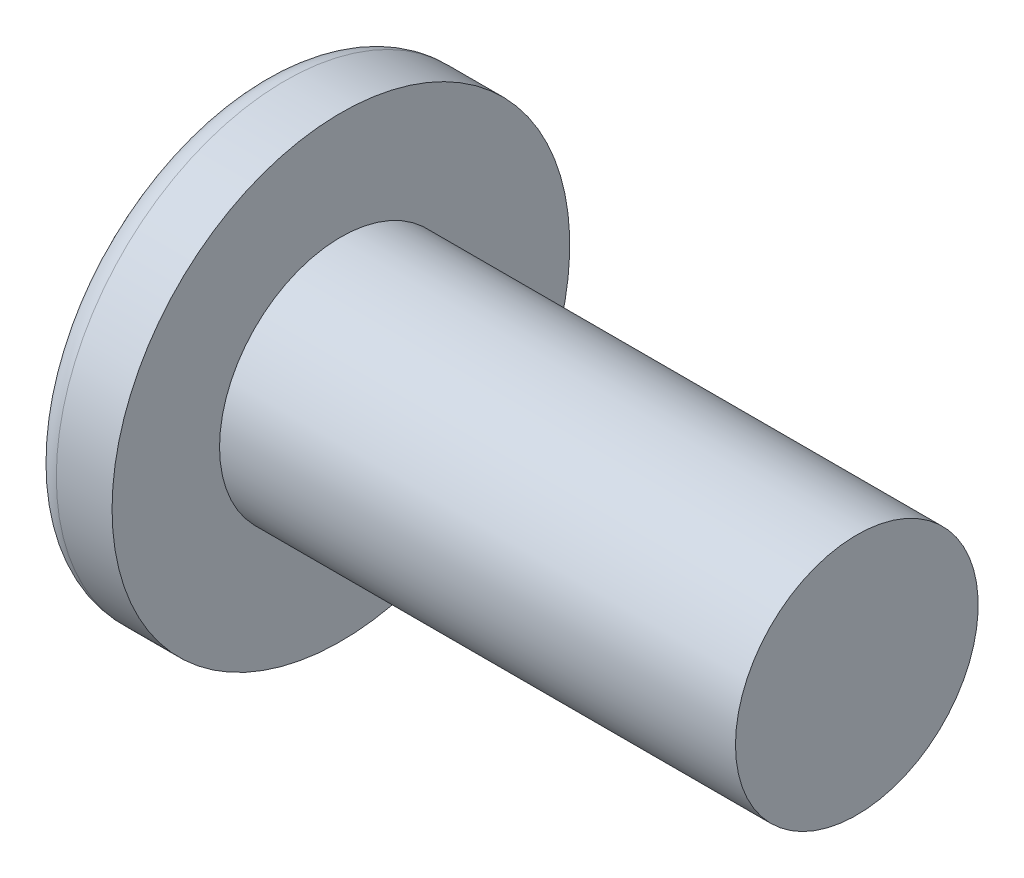
ISO-10303-21;
HEADER;
FILE_DESCRIPTION(('STEP AP214'),'2;1');
FILE_NAME('part.step','',(''),(''),'','','');
FILE_SCHEMA(('AUTOMOTIVE_DESIGN { 1 0 10303 214 1 1 1 1 }'));
ENDSEC;
DATA;
#1=APPLICATION_CONTEXT('core data for automotive mechanical design processes');
#2=APPLICATION_PROTOCOL_DEFINITION('international standard','automotive_design',2000,#1);
#3=PRODUCT_CONTEXT('',#1,'mechanical');
#4=PRODUCT('Part','Part','',(#3));
#5=PRODUCT_RELATED_PRODUCT_CATEGORY('part','',(#4));
#6=PRODUCT_DEFINITION_FORMATION('','',#4);
#7=PRODUCT_DEFINITION_CONTEXT('part definition',#1,'design');
#8=PRODUCT_DEFINITION('design','',#6,#7);
#9=PRODUCT_DEFINITION_SHAPE('','',#8);
#10=(LENGTH_UNIT() NAMED_UNIT(*) SI_UNIT(.MILLI.,.METRE.));
#11=(NAMED_UNIT(*) PLANE_ANGLE_UNIT() SI_UNIT($,.RADIAN.));
#12=(NAMED_UNIT(*) SI_UNIT($,.STERADIAN.) SOLID_ANGLE_UNIT());
#13=UNCERTAINTY_MEASURE_WITH_UNIT(LENGTH_MEASURE(1.E-05),#10,'distance_accuracy_value','');
#14=(GEOMETRIC_REPRESENTATION_CONTEXT(3) GLOBAL_UNCERTAINTY_ASSIGNED_CONTEXT((#13)) GLOBAL_UNIT_ASSIGNED_CONTEXT((#10,
#11,#12)) REPRESENTATION_CONTEXT('',''));
#15=CARTESIAN_POINT('',(0.,0.,0.));
#16=DIRECTION('',(0.,0.,1.));
#17=DIRECTION('',(1.,0.,0.));
#18=AXIS2_PLACEMENT_3D('',#15,#16,#17);
#19=CARTESIAN_POINT('',(6.6,0.,0.));
#20=DIRECTION('',(-1.,0.,0.));
#21=DIRECTION('',(0.,1.,0.));
#22=AXIS2_PLACEMENT_3D('',#19,#20,#21);
#23=SPHERICAL_SURFACE('',#22,6.6);
#24=CARTESIAN_POINT('',(0.778463075805213,0.,0.));
#25=DIRECTION('',(-1.,0.,0.));
#26=DIRECTION('',(0.,0.,1.));
#27=AXIS2_PLACEMENT_3D('',#24,#25,#26);
#28=CIRCLE('',#27,3.10961538461538);
#29=CARTESIAN_POINT('',(0.778463075805213,0.,3.10961538461538));
#30=VERTEX_POINT('',#29);
#31=EDGE_CURVE('E152',#30,#30,#28,.T.);
#32=ORIENTED_EDGE('',*,*,#31,.T.);
#33=EDGE_LOOP('',(#32));
#34=FACE_BOUND('',#33,.T.);
#35=CARTESIAN_POINT('',(6.56634135049053,-0.32021201695497,0.));
#36=DIRECTION('',(-0.104537710696287,-0.994520923380891,0.));
#37=DIRECTION('',(0.994520923380891,-0.104537710696287,0.));
#38=AXIS2_PLACEMENT_3D('',#35,#36,#37);
#39=CIRCLE('',#38,6.59214163679079);
#40=CARTESIAN_POINT('',(0.147950510546276,0.35444838383462,1.34366057054486));
#41=VERTEX_POINT('',#40);
#42=CARTESIAN_POINT('',(0.0205330780491553,0.367841693500514,0.367841693500515));
#43=VERTEX_POINT('',#42);
#44=EDGE_CURVE('E183',#41,#43,#39,.T.);
#45=ORIENTED_EDGE('',*,*,#44,.F.);
#46=CARTESIAN_POINT('',(5.03902124919511,0.,-2.17179652285898));
#47=DIRECTION('',(0.583636048152575,0.,0.812015371342713));
#48=DIRECTION('',(0.812015371342714,0.,-0.583636048152575));
#49=AXIS2_PLACEMENT_3D('',#46,#47,#48);
#50=CIRCLE('',#49,6.03379194228913);
#51=CARTESIAN_POINT('',(0.147950510546276,-0.354448383834629,1.34366057054486));
#52=VERTEX_POINT('',#51);
#53=EDGE_CURVE('E148',#41,#52,#50,.T.);
#54=ORIENTED_EDGE('',*,*,#53,.T.);
#55=CARTESIAN_POINT('',(6.56634135049053,0.320212016954969,0.));
#56=DIRECTION('',(-0.104537710696287,0.994520923380891,0.));
#57=DIRECTION('',(-0.994520923380891,-0.104537710696287,0.));
#58=AXIS2_PLACEMENT_3D('',#55,#56,#57);
#59=CIRCLE('',#58,6.59214163679079);
#60=CARTESIAN_POINT('',(0.0205330780491545,-0.367841693500516,0.367841693500515));
#61=VERTEX_POINT('',#60);
#62=EDGE_CURVE('E104',#61,#52,#59,.T.);
#63=ORIENTED_EDGE('',*,*,#62,.F.);
#64=CARTESIAN_POINT('',(6.56634135049053,0.,-0.320212016954969));
#65=DIRECTION('',(-0.104537710696287,0.,-0.994520923380891));
#66=DIRECTION('',(-0.994520923380891,0.,0.104537710696287));
#67=AXIS2_PLACEMENT_3D('',#64,#65,#66);
#68=CIRCLE('',#67,6.59214163679079);
#69=CARTESIAN_POINT('',(0.147950510546277,-1.34366057054486,0.354448383834624));
#70=VERTEX_POINT('',#69);
#71=EDGE_CURVE('E129',#70,#61,#68,.T.);
#72=ORIENTED_EDGE('',*,*,#71,.F.);
#73=CARTESIAN_POINT('',(5.03902124919511,2.17179652285898,0.));
#74=DIRECTION('',(0.583636048152575,-0.812015371342713,0.));
#75=DIRECTION('',(0.812015371342714,0.583636048152575,0.));
#76=AXIS2_PLACEMENT_3D('',#73,#74,#75);
#77=CIRCLE('',#76,6.03379194228913);
#78=CARTESIAN_POINT('',(0.147950510546277,-1.34366057054486,-0.354448383834624));
#79=VERTEX_POINT('',#78);
#80=EDGE_CURVE('E137',#70,#79,#77,.T.);
#81=ORIENTED_EDGE('',*,*,#80,.T.);
#82=CARTESIAN_POINT('',(6.56634135049053,0.,0.32021201695497));
#83=DIRECTION('',(-0.104537710696287,0.,0.994520923380891));
#84=DIRECTION('',(0.994520923380891,0.,0.104537710696287));
#85=AXIS2_PLACEMENT_3D('',#82,#83,#84);
#86=CIRCLE('',#85,6.59214163679079);
#87=CARTESIAN_POINT('',(0.0205330780491553,-0.367841693500513,-0.367841693500515));
#88=VERTEX_POINT('',#87);
#89=EDGE_CURVE('E47',#88,#79,#86,.T.);
#90=ORIENTED_EDGE('',*,*,#89,.F.);
#91=CARTESIAN_POINT('',(0.147950510546278,-0.354448383834619,-1.34366057054487));
#92=VERTEX_POINT('',#91);
#93=EDGE_CURVE('E190',#92,#88,#59,.T.);
#94=ORIENTED_EDGE('',*,*,#93,.F.);
#95=CARTESIAN_POINT('',(5.03902124919511,0.,2.17179652285898));
#96=DIRECTION('',(0.583636048152575,0.,-0.812015371342713));
#97=DIRECTION('',(-0.812015371342714,0.,-0.583636048152575));
#98=AXIS2_PLACEMENT_3D('',#95,#96,#97);
#99=CIRCLE('',#98,6.03379194228913);
#100=CARTESIAN_POINT('',(0.147950510546278,0.354448383834629,-1.34366057054486));
#101=VERTEX_POINT('',#100);
#102=EDGE_CURVE('E130',#92,#101,#99,.T.);
#103=ORIENTED_EDGE('',*,*,#102,.T.);
#104=CARTESIAN_POINT('',(0.0205330780491545,0.367841693500516,-0.367841693500515));
#105=VERTEX_POINT('',#104);
#106=EDGE_CURVE('E178',#105,#101,#39,.T.);
#107=ORIENTED_EDGE('',*,*,#106,.F.);
#108=CARTESIAN_POINT('',(0.147950510546276,1.34366057054486,-0.354448383834624));
#109=VERTEX_POINT('',#108);
#110=EDGE_CURVE('E40',#109,#105,#86,.T.);
#111=ORIENTED_EDGE('',*,*,#110,.F.);
#112=CARTESIAN_POINT('',(5.03902124919511,-2.17179652285898,0.));
#113=DIRECTION('',(0.583636048152575,0.812015371342713,0.));
#114=DIRECTION('',(-0.812015371342714,0.583636048152575,0.));
#115=AXIS2_PLACEMENT_3D('',#112,#113,#114);
#116=CIRCLE('',#115,6.03379194228913);
#117=CARTESIAN_POINT('',(0.147950510546277,1.34366057054486,0.354448383834624));
#118=VERTEX_POINT('',#117);
#119=EDGE_CURVE('E11',#109,#118,#116,.T.);
#120=ORIENTED_EDGE('',*,*,#119,.T.);
#121=EDGE_CURVE('E166',#43,#118,#68,.T.);
#122=ORIENTED_EDGE('',*,*,#121,.F.);
#123=EDGE_LOOP('',(#45,#54,#63,#72,#81,#90,#94,#103,#107,#111,#120,#122));
#124=FACE_BOUND('',#123,.T.);
#125=ADVANCED_FACE('F32',(#34,#124),#23,.T.);
#126=CARTESIAN_POINT('',(2.01739130434783,0.,-0.15794466403162));
#127=DIRECTION('',(-0.104537710696287,0.,0.994520923380891));
#128=DIRECTION('',(0.994520923380891,0.,0.104537710696287));
#129=AXIS2_PLACEMENT_3D('',#126,#127,#128);
#130=PLANE('',#129);
#131=ORIENTED_EDGE('',*,*,#110,.T.);
#132=DIRECTION('',(0.989130931836555,-0.103971149085093,0.103971149085092));
#133=VECTOR('',#132,1.);
#134=CARTESIAN_POINT('',(2.03363450411053,0.156237282238383,-0.156237282238382));
#135=LINE('',#134,#133);
#136=CARTESIAN_POINT('',(1.76,0.185000000000001,-0.184999999999999));
#137=VERTEX_POINT('',#136);
#138=EDGE_CURVE('E172',#105,#137,#135,.T.);
#139=ORIENTED_EDGE('',*,*,#138,.T.);
#140=DIRECTION('',(0.80907355338853,-0.581521616498006,0.0850446632823171));
#141=VECTOR('',#140,1.);
#142=CARTESIAN_POINT('',(0.,1.45,-0.37));
#143=LINE('',#142,#141);
#144=EDGE_CURVE('E153',#109,#137,#143,.T.);
#145=ORIENTED_EDGE('',*,*,#144,.F.);
#146=EDGE_LOOP('',(#131,#139,#145));
#147=FACE_BOUND('',#146,.T.);
#148=ADVANCED_FACE('F171',(#147),#130,.T.);
#149=DIRECTION('',(0.80907355338853,0.581521616498006,0.0850446632823171));
#150=VECTOR('',#149,1.);
#151=CARTESIAN_POINT('',(0.,-1.45,-0.37));
#152=LINE('',#151,#150);
#153=CARTESIAN_POINT('',(1.76,-0.185,-0.185));
#154=VERTEX_POINT('',#153);
#155=EDGE_CURVE('E138',#79,#154,#152,.T.);
#156=ORIENTED_EDGE('',*,*,#155,.T.);
#157=DIRECTION('',(-0.989130931836555,-0.103971149085092,-0.103971149085092));
#158=VECTOR('',#157,1.);
#159=CARTESIAN_POINT('',(2.03363450411053,-0.156237282238382,-0.156237282238382));
#160=LINE('',#159,#158);
#161=EDGE_CURVE('E193',#154,#88,#160,.T.);
#162=ORIENTED_EDGE('',*,*,#161,.T.);
#163=ORIENTED_EDGE('',*,*,#89,.T.);
#164=EDGE_LOOP('',(#156,#162,#163));
#165=FACE_BOUND('',#164,.T.);
#166=ADVANCED_FACE('F208',(#165),#130,.T.);
#167=CARTESIAN_POINT('',(2.01739130434783,0.,0.157944664031621));
#168=DIRECTION('',(-0.104537710696287,0.,-0.994520923380891));
#169=DIRECTION('',(-0.994520923380891,0.,0.104537710696287));
#170=AXIS2_PLACEMENT_3D('',#167,#168,#169);
#171=PLANE('',#170);
#172=DIRECTION('',(0.80907355338853,-0.581521616498006,-0.085044663282317));
#173=VECTOR('',#172,1.);
#174=CARTESIAN_POINT('',(0.,1.45,0.37));
#175=LINE('',#174,#173);
#176=CARTESIAN_POINT('',(1.76,0.185,0.185));
#177=VERTEX_POINT('',#176);
#178=EDGE_CURVE('E209',#118,#177,#175,.T.);
#179=ORIENTED_EDGE('',*,*,#178,.T.);
#180=DIRECTION('',(-0.989130931836555,0.103971149085092,0.103971149085092));
#181=VECTOR('',#180,1.);
#182=CARTESIAN_POINT('',(2.03363450411053,0.156237282238382,0.156237282238382));
#183=LINE('',#182,#181);
#184=EDGE_CURVE('E187',#177,#43,#183,.T.);
#185=ORIENTED_EDGE('',*,*,#184,.T.);
#186=ORIENTED_EDGE('',*,*,#121,.T.);
#187=EDGE_LOOP('',(#179,#185,#186));
#188=FACE_BOUND('',#187,.T.);
#189=ADVANCED_FACE('F213',(#188),#171,.T.);
#190=ORIENTED_EDGE('',*,*,#71,.T.);
#191=DIRECTION('',(0.989130931836555,0.103971149085093,-0.103971149085092));
#192=VECTOR('',#191,1.);
#193=CARTESIAN_POINT('',(2.03363450411053,-0.156237282238383,0.156237282238382));
#194=LINE('',#193,#192);
#195=CARTESIAN_POINT('',(1.76,-0.185000000000001,0.184999999999999));
#196=VERTEX_POINT('',#195);
#197=EDGE_CURVE('E102',#61,#196,#194,.T.);
#198=ORIENTED_EDGE('',*,*,#197,.T.);
#199=DIRECTION('',(0.80907355338853,0.581521616498006,-0.0850446632823168));
#200=VECTOR('',#199,1.);
#201=CARTESIAN_POINT('',(0.,-1.45,0.369999999999999));
#202=LINE('',#201,#200);
#203=EDGE_CURVE('E127',#70,#196,#202,.T.);
#204=ORIENTED_EDGE('',*,*,#203,.F.);
#205=EDGE_LOOP('',(#190,#198,#204));
#206=FACE_BOUND('',#205,.T.);
#207=ADVANCED_FACE('F126',(#206),#171,.T.);
#208=CARTESIAN_POINT('',(-25.4,0.,0.));
#209=DIRECTION('',(-1.,0.,0.));
#210=DIRECTION('',(0.,0.,1.));
#211=AXIS2_PLACEMENT_3D('',#208,#209,#210);
#212=CYLINDRICAL_SURFACE('',#211,1.75);
#213=CARTESIAN_POINT('',(9.34,0.,0.));
#214=DIRECTION('',(-1.,0.,0.));
#215=DIRECTION('',(0.,0.,1.));
#216=AXIS2_PLACEMENT_3D('',#213,#214,#215);
#217=CIRCLE('',#216,1.75);
#218=CARTESIAN_POINT('',(9.34,0.,1.75));
#219=VERTEX_POINT('',#218);
#220=EDGE_CURVE('E149',#219,#219,#217,.T.);
#221=ORIENTED_EDGE('',*,*,#220,.T.);
#222=EDGE_LOOP('',(#221));
#223=FACE_BOUND('',#222,.T.);
#224=CARTESIAN_POINT('',(1.9,0.,0.));
#225=DIRECTION('',(-1.,0.,0.));
#226=DIRECTION('',(0.,0.,1.));
#227=AXIS2_PLACEMENT_3D('',#224,#225,#226);
#228=CIRCLE('',#227,1.75);
#229=CARTESIAN_POINT('',(1.9,0.,1.75));
#230=VERTEX_POINT('',#229);
#231=EDGE_CURVE('E162',#230,#230,#228,.T.);
#232=ORIENTED_EDGE('',*,*,#231,.F.);
#233=EDGE_LOOP('',(#232));
#234=FACE_BOUND('',#233,.T.);
#235=ADVANCED_FACE('F34',(#223,#234),#212,.T.);
#236=CARTESIAN_POINT('',(1.9,1.75,0.));
#237=DIRECTION('',(-1.,0.,0.));
#238=DIRECTION('',(0.,0.,1.));
#239=AXIS2_PLACEMENT_3D('',#236,#237,#238);
#240=PLANE('',#239);
#241=CARTESIAN_POINT('',(1.9,0.,0.));
#242=DIRECTION('',(-1.,0.,0.));
#243=DIRECTION('',(0.,0.,1.));
#244=AXIS2_PLACEMENT_3D('',#241,#242,#243);
#245=CIRCLE('',#244,3.3);
#246=CARTESIAN_POINT('',(1.9,0.,3.3));
#247=VERTEX_POINT('',#246);
#248=EDGE_CURVE('E159',#247,#247,#245,.T.);
#249=ORIENTED_EDGE('',*,*,#248,.F.);
#250=EDGE_LOOP('',(#249));
#251=FACE_BOUND('',#250,.T.);
#252=ORIENTED_EDGE('',*,*,#231,.T.);
#253=EDGE_LOOP('',(#252));
#254=FACE_BOUND('',#253,.T.);
#255=ADVANCED_FACE('F241',(#251,#254),#240,.F.);
#256=CARTESIAN_POINT('',(-25.4,0.,0.));
#257=DIRECTION('',(-1.,0.,0.));
#258=DIRECTION('',(0.,0.,1.));
#259=AXIS2_PLACEMENT_3D('',#256,#257,#258);
#260=CYLINDRICAL_SURFACE('',#259,3.3);
#261=ORIENTED_EDGE('',*,*,#248,.T.);
#262=EDGE_LOOP('',(#261));
#263=FACE_BOUND('',#262,.T.);
#264=CARTESIAN_POINT('',(1.09600145348857,0.,0.));
#265=DIRECTION('',(-1.,0.,0.));
#266=DIRECTION('',(0.,0.,1.));
#267=AXIS2_PLACEMENT_3D('',#264,#265,#266);
#268=CIRCLE('',#267,3.3);
#269=CARTESIAN_POINT('',(1.09600145348857,0.,3.3));
#270=VERTEX_POINT('',#269);
#271=EDGE_CURVE('E156',#270,#270,#268,.T.);
#272=ORIENTED_EDGE('',*,*,#271,.F.);
#273=EDGE_LOOP('',(#272));
#274=FACE_BOUND('',#273,.T.);
#275=ADVANCED_FACE('F238',(#263,#274),#260,.T.);
#276=CARTESIAN_POINT('',(1.09600145348856,0.,0.));
#277=DIRECTION('',(-1.,0.,0.));
#278=DIRECTION('',(0.,0.,1.));
#279=AXIS2_PLACEMENT_3D('',#276,#277,#278);
#280=TOROIDAL_SURFACE('',#279,2.94,0.359999999999999);
#281=ORIENTED_EDGE('',*,*,#271,.T.);
#282=EDGE_LOOP('',(#281));
#283=FACE_BOUND('',#282,.T.);
#284=ORIENTED_EDGE('',*,*,#31,.F.);
#285=EDGE_LOOP('',(#284));
#286=FACE_BOUND('',#285,.T.);
#287=ADVANCED_FACE('F235',(#283,#286),#280,.T.);
#288=CARTESIAN_POINT('',(9.34,1.75,0.));
#289=DIRECTION('',(1.,0.,0.));
#290=DIRECTION('',(0.,0.,-1.));
#291=AXIS2_PLACEMENT_3D('',#288,#289,#290);
#292=PLANE('',#291);
#293=ORIENTED_EDGE('',*,*,#220,.F.);
#294=EDGE_LOOP('',(#293));
#295=FACE_BOUND('',#294,.T.);
#296=ADVANCED_FACE('F233',(#295),#292,.T.);
#297=CARTESIAN_POINT('',(1.76,0.185,0.185));
#298=DIRECTION('',(0.583636048152575,0.812015371342713,0.));
#299=DIRECTION('',(-0.812015371342714,0.583636048152575,0.));
#300=AXIS2_PLACEMENT_3D('',#297,#298,#299);
#301=PLANE('',#300);
#302=ORIENTED_EDGE('',*,*,#144,.T.);
#303=DIRECTION('',(0.,0.,-1.));
#304=VECTOR('',#303,1.);
#305=CARTESIAN_POINT('',(1.76,0.185,0.185));
#306=LINE('',#305,#304);
#307=EDGE_CURVE('E120',#177,#137,#306,.T.);
#308=ORIENTED_EDGE('',*,*,#307,.F.);
#309=ORIENTED_EDGE('',*,*,#178,.F.);
#310=ORIENTED_EDGE('',*,*,#119,.F.);
#311=EDGE_LOOP('',(#302,#308,#309,#310));
#312=FACE_BOUND('',#311,.T.);
#313=ADVANCED_FACE('F212',(#312),#301,.F.);
#314=CARTESIAN_POINT('',(1.76,-0.185,-0.185));
#315=DIRECTION('',(0.583636048152575,-0.812015371342713,0.));
#316=DIRECTION('',(0.812015371342714,0.583636048152575,0.));
#317=AXIS2_PLACEMENT_3D('',#314,#315,#316);
#318=PLANE('',#317);
#319=ORIENTED_EDGE('',*,*,#203,.T.);
#320=DIRECTION('',(0.,0.,1.));
#321=VECTOR('',#320,1.);
#322=CARTESIAN_POINT('',(1.76,-0.185,-0.185));
#323=LINE('',#322,#321);
#324=EDGE_CURVE('E119',#154,#196,#323,.T.);
#325=ORIENTED_EDGE('',*,*,#324,.F.);
#326=ORIENTED_EDGE('',*,*,#155,.F.);
#327=ORIENTED_EDGE('',*,*,#80,.F.);
#328=EDGE_LOOP('',(#319,#325,#326,#327));
#329=FACE_BOUND('',#328,.T.);
#330=ADVANCED_FACE('F134',(#329),#318,.F.);
#331=CARTESIAN_POINT('',(1.76,0.185,-0.185));
#332=DIRECTION('',(-1.,0.,0.));
#333=DIRECTION('',(0.,0.,1.));
#334=AXIS2_PLACEMENT_3D('',#331,#332,#333);
#335=PLANE('',#334);
#336=DIRECTION('',(0.,1.,0.));
#337=VECTOR('',#336,1.);
#338=CARTESIAN_POINT('',(1.76,-0.185,-0.185));
#339=LINE('',#338,#337);
#340=EDGE_CURVE('E142',#154,#137,#339,.T.);
#341=ORIENTED_EDGE('',*,*,#340,.F.);
#342=ORIENTED_EDGE('',*,*,#324,.T.);
#343=DIRECTION('',(0.,-1.,0.));
#344=VECTOR('',#343,1.);
#345=CARTESIAN_POINT('',(1.76,0.185,0.185));
#346=LINE('',#345,#344);
#347=EDGE_CURVE('E111',#177,#196,#346,.T.);
#348=ORIENTED_EDGE('',*,*,#347,.F.);
#349=ORIENTED_EDGE('',*,*,#307,.T.);
#350=EDGE_LOOP('',(#341,#342,#348,#349));
#351=FACE_BOUND('',#350,.T.);
#352=ADVANCED_FACE('F140',(#351),#335,.T.);
#353=CARTESIAN_POINT('',(1.76,0.185000000000001,-0.184999999999999));
#354=DIRECTION('',(0.583636048152575,0.,-0.812015371342713));
#355=DIRECTION('',(0.812015371342714,0.,0.583636048152575));
#356=AXIS2_PLACEMENT_3D('',#353,#354,#355);
#357=PLANE('',#356);
#358=DIRECTION('',(0.80907355338853,0.0850446632823148,0.581521616498006));
#359=VECTOR('',#358,1.);
#360=CARTESIAN_POINT('',(0.,-0.369999999999994,-1.45));
#361=LINE('',#360,#359);
#362=EDGE_CURVE('E198',#92,#154,#361,.T.);
#363=ORIENTED_EDGE('',*,*,#362,.T.);
#364=ORIENTED_EDGE('',*,*,#340,.T.);
#365=DIRECTION('',(0.80907355338853,-0.0850446632823191,0.581521616498006));
#366=VECTOR('',#365,1.);
#367=CARTESIAN_POINT('',(0.,0.370000000000005,-1.45));
#368=LINE('',#367,#366);
#369=EDGE_CURVE('E108',#101,#137,#368,.T.);
#370=ORIENTED_EDGE('',*,*,#369,.F.);
#371=ORIENTED_EDGE('',*,*,#102,.F.);
#372=EDGE_LOOP('',(#363,#364,#370,#371));
#373=FACE_BOUND('',#372,.T.);
#374=ADVANCED_FACE('F203',(#373),#357,.F.);
#375=CARTESIAN_POINT('',(2.01739130434783,-0.157944664031621,0.));
#376=DIRECTION('',(-0.104537710696287,0.994520923380891,0.));
#377=DIRECTION('',(-0.994520923380891,-0.104537710696287,0.));
#378=AXIS2_PLACEMENT_3D('',#375,#376,#377);
#379=PLANE('',#378);
#380=ORIENTED_EDGE('',*,*,#93,.T.);
#381=ORIENTED_EDGE('',*,*,#161,.F.);
#382=ORIENTED_EDGE('',*,*,#362,.F.);
#383=EDGE_LOOP('',(#380,#381,#382));
#384=FACE_BOUND('',#383,.T.);
#385=ADVANCED_FACE('F207',(#384),#379,.T.);
#386=CARTESIAN_POINT('',(2.01739130434783,0.15794466403162,0.));
#387=DIRECTION('',(-0.104537710696287,-0.994520923380891,0.));
#388=DIRECTION('',(0.994520923380891,-0.104537710696287,0.));
#389=AXIS2_PLACEMENT_3D('',#386,#387,#388);
#390=PLANE('',#389);
#391=ORIENTED_EDGE('',*,*,#106,.T.);
#392=ORIENTED_EDGE('',*,*,#369,.T.);
#393=ORIENTED_EDGE('',*,*,#138,.F.);
#394=EDGE_LOOP('',(#391,#392,#393));
#395=FACE_BOUND('',#394,.T.);
#396=ADVANCED_FACE('F201',(#395),#390,.T.);
#397=CARTESIAN_POINT('',(1.76,-0.185000000000001,0.184999999999999));
#398=DIRECTION('',(0.583636048152575,0.,0.812015371342713));
#399=DIRECTION('',(-0.812015371342714,0.,0.583636048152575));
#400=AXIS2_PLACEMENT_3D('',#397,#398,#399);
#401=PLANE('',#400);
#402=DIRECTION('',(0.80907355338853,-0.0850446632823151,-0.581521616498006));
#403=VECTOR('',#402,1.);
#404=CARTESIAN_POINT('',(0.,0.369999999999995,1.45));
#405=LINE('',#404,#403);
#406=EDGE_CURVE('E107',#41,#177,#405,.T.);
#407=ORIENTED_EDGE('',*,*,#406,.T.);
#408=ORIENTED_EDGE('',*,*,#347,.T.);
#409=DIRECTION('',(0.80907355338853,0.085044663282319,-0.581521616498006));
#410=VECTOR('',#409,1.);
#411=CARTESIAN_POINT('',(0.,-0.370000000000005,1.45));
#412=LINE('',#411,#410);
#413=EDGE_CURVE('E98',#52,#196,#412,.T.);
#414=ORIENTED_EDGE('',*,*,#413,.F.);
#415=ORIENTED_EDGE('',*,*,#53,.F.);
#416=EDGE_LOOP('',(#407,#408,#414,#415));
#417=FACE_BOUND('',#416,.T.);
#418=ADVANCED_FACE('F112',(#417),#401,.F.);
#419=ORIENTED_EDGE('',*,*,#44,.T.);
#420=ORIENTED_EDGE('',*,*,#184,.F.);
#421=ORIENTED_EDGE('',*,*,#406,.F.);
#422=EDGE_LOOP('',(#419,#420,#421));
#423=FACE_BOUND('',#422,.T.);
#424=ADVANCED_FACE('F214',(#423),#390,.T.);
#425=ORIENTED_EDGE('',*,*,#62,.T.);
#426=ORIENTED_EDGE('',*,*,#413,.T.);
#427=ORIENTED_EDGE('',*,*,#197,.F.);
#428=EDGE_LOOP('',(#425,#426,#427));
#429=FACE_BOUND('',#428,.T.);
#430=ADVANCED_FACE('F100',(#429),#379,.T.);
#431=CLOSED_SHELL('',(#125,#148,#166,#189,#207,#235,#255,#275,#287,#296,#313,#330,#352,#374,
#385,#396,#418,#424,#430));
#432=MANIFOLD_SOLID_BREP('B2',#431);
#433=ADVANCED_BREP_SHAPE_REPRESENTATION('',(#18,#432),#14);
#434=SHAPE_DEFINITION_REPRESENTATION(#9,#433);
ENDSEC;
END-ISO-10303-21;
